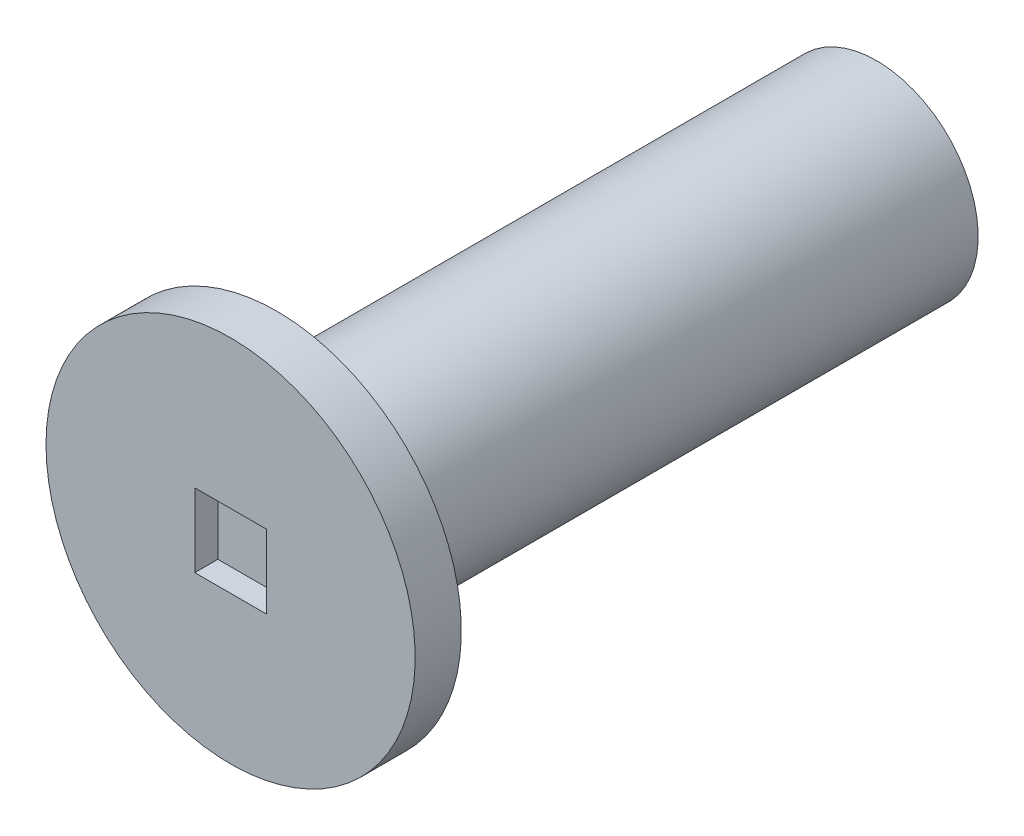
ISO-10303-21;
HEADER;
FILE_DESCRIPTION(('STEP AP214'),'2;1');
FILE_NAME('part.step','',(''),(''),'','','');
FILE_SCHEMA(('AUTOMOTIVE_DESIGN { 1 0 10303 214 1 1 1 1 }'));
ENDSEC;
DATA;
#1=APPLICATION_CONTEXT('core data for automotive mechanical design processes');
#2=APPLICATION_PROTOCOL_DEFINITION('international standard','automotive_design',2000,#1);
#3=PRODUCT_CONTEXT('',#1,'mechanical');
#4=PRODUCT('Part','Part','',(#3));
#5=PRODUCT_RELATED_PRODUCT_CATEGORY('part','',(#4));
#6=PRODUCT_DEFINITION_FORMATION('','',#4);
#7=PRODUCT_DEFINITION_CONTEXT('part definition',#1,'design');
#8=PRODUCT_DEFINITION('design','',#6,#7);
#9=PRODUCT_DEFINITION_SHAPE('','',#8);
#10=(LENGTH_UNIT() NAMED_UNIT(*) SI_UNIT(.MILLI.,.METRE.));
#11=(NAMED_UNIT(*) PLANE_ANGLE_UNIT() SI_UNIT($,.RADIAN.));
#12=(NAMED_UNIT(*) SI_UNIT($,.STERADIAN.) SOLID_ANGLE_UNIT());
#13=UNCERTAINTY_MEASURE_WITH_UNIT(LENGTH_MEASURE(1.E-05),#10,'distance_accuracy_value','');
#14=(GEOMETRIC_REPRESENTATION_CONTEXT(3) GLOBAL_UNCERTAINTY_ASSIGNED_CONTEXT((#13)) GLOBAL_UNIT_ASSIGNED_CONTEXT((#10,
#11,#12)) REPRESENTATION_CONTEXT('',''));
#15=CARTESIAN_POINT('',(0.,0.,0.));
#16=DIRECTION('',(0.,0.,1.));
#17=DIRECTION('',(1.,0.,0.));
#18=AXIS2_PLACEMENT_3D('',#15,#16,#17);
#19=CARTESIAN_POINT('',(0.,0.,0.));
#20=DIRECTION('',(0.,0.,1.));
#21=DIRECTION('',(1.,0.,0.));
#22=AXIS2_PLACEMENT_3D('',#19,#20,#21);
#23=PLANE('',#22);
#24=CARTESIAN_POINT('',(0.,0.,0.));
#25=DIRECTION('',(0.,0.,1.));
#26=DIRECTION('',(1.,0.,0.));
#27=AXIS2_PLACEMENT_3D('',#24,#25,#26);
#28=CIRCLE('',#27,2.2);
#29=CARTESIAN_POINT('',(-2.2,0.,0.));
#30=VERTEX_POINT('',#29);
#31=EDGE_CURVE('E20',#30,#30,#28,.T.);
#32=ORIENTED_EDGE('',*,*,#31,.T.);
#33=EDGE_LOOP('',(#32));
#34=FACE_BOUND('',#33,.T.);
#35=CARTESIAN_POINT('',(0.,0.,0.));
#36=DIRECTION('',(0.,0.,1.));
#37=DIRECTION('',(1.,0.,0.));
#38=AXIS2_PLACEMENT_3D('',#35,#36,#37);
#39=CIRCLE('',#38,4.);
#40=CARTESIAN_POINT('',(-4.,0.,0.));
#41=VERTEX_POINT('',#40);
#42=EDGE_CURVE('E11',#41,#41,#39,.T.);
#43=ORIENTED_EDGE('',*,*,#42,.F.);
#44=EDGE_LOOP('',(#43));
#45=FACE_BOUND('',#44,.T.);
#46=ADVANCED_FACE('F16',(#34,#45),#23,.F.);
#47=CARTESIAN_POINT('',(0.,0.,1.));
#48=DIRECTION('',(0.,0.,1.));
#49=DIRECTION('',(1.,0.,0.));
#50=AXIS2_PLACEMENT_3D('',#47,#48,#49);
#51=PLANE('',#50);
#52=DIRECTION('',(0.,1.,0.));
#53=VECTOR('',#52,1.);
#54=CARTESIAN_POINT('',(-0.775906475947883,-0.398152632129984,1.));
#55=LINE('',#54,#53);
#56=CARTESIAN_POINT('',(-0.775906475947883,-0.796305264259968,1.));
#57=VERTEX_POINT('',#56);
#58=CARTESIAN_POINT('',(-0.775906475947883,0.796305264259968,1.));
#59=VERTEX_POINT('',#58);
#60=EDGE_CURVE('E102',#57,#59,#55,.T.);
#61=ORIENTED_EDGE('',*,*,#60,.T.);
#62=DIRECTION('',(1.,0.,0.));
#63=VECTOR('',#62,1.);
#64=CARTESIAN_POINT('',(-0.387953237973941,0.796305264259968,1.));
#65=LINE('',#64,#63);
#66=CARTESIAN_POINT('',(0.775906475947883,0.796305264259968,1.));
#67=VERTEX_POINT('',#66);
#68=EDGE_CURVE('E135',#59,#67,#65,.T.);
#69=ORIENTED_EDGE('',*,*,#68,.T.);
#70=DIRECTION('',(0.,-1.,0.));
#71=VECTOR('',#70,1.);
#72=CARTESIAN_POINT('',(0.775906475947883,0.398152632129984,1.));
#73=LINE('',#72,#71);
#74=CARTESIAN_POINT('',(0.775906475947883,-0.796305264259968,1.));
#75=VERTEX_POINT('',#74);
#76=EDGE_CURVE('E118',#67,#75,#73,.T.);
#77=ORIENTED_EDGE('',*,*,#76,.T.);
#78=DIRECTION('',(-1.,0.,0.));
#79=VECTOR('',#78,1.);
#80=CARTESIAN_POINT('',(0.387953237973941,-0.796305264259968,1.));
#81=LINE('',#80,#79);
#82=EDGE_CURVE('E127',#75,#57,#81,.T.);
#83=ORIENTED_EDGE('',*,*,#82,.T.);
#84=EDGE_LOOP('',(#61,#69,#77,#83));
#85=FACE_BOUND('',#84,.T.);
#86=CARTESIAN_POINT('',(0.,0.,1.));
#87=DIRECTION('',(0.,0.,1.));
#88=DIRECTION('',(1.,0.,0.));
#89=AXIS2_PLACEMENT_3D('',#86,#87,#88);
#90=CIRCLE('',#89,4.);
#91=CARTESIAN_POINT('',(-4.,0.,1.));
#92=VERTEX_POINT('',#91);
#93=EDGE_CURVE('E121',#92,#92,#90,.T.);
#94=ORIENTED_EDGE('',*,*,#93,.T.);
#95=EDGE_LOOP('',(#94));
#96=FACE_BOUND('',#95,.T.);
#97=ADVANCED_FACE('F145',(#85,#96),#51,.T.);
#98=CARTESIAN_POINT('',(0.,0.,0.));
#99=DIRECTION('',(0.,0.,1.));
#100=DIRECTION('',(1.,0.,0.));
#101=AXIS2_PLACEMENT_3D('',#98,#99,#100);
#102=CYLINDRICAL_SURFACE('',#101,4.);
#103=ORIENTED_EDGE('',*,*,#93,.F.);
#104=DIRECTION('',(0.,0.,-1.));
#105=VECTOR('',#104,1.);
#106=CARTESIAN_POINT('',(-4.,0.,0.));
#107=LINE('',#106,#105);
#108=EDGE_CURVE('E27',#92,#41,#107,.T.);
#109=ORIENTED_EDGE('',*,*,#108,.T.);
#110=ORIENTED_EDGE('',*,*,#42,.T.);
#111=ORIENTED_EDGE('',*,*,#108,.F.);
#112=EDGE_LOOP('',(#103,#109,#110,#111));
#113=FACE_BOUND('',#112,.T.);
#114=ADVANCED_FACE('F233',(#113),#102,.T.);
#115=CARTESIAN_POINT('',(0.,0.,0.));
#116=DIRECTION('',(0.,0.,-1.));
#117=DIRECTION('',(1.,0.,0.));
#118=AXIS2_PLACEMENT_3D('',#115,#116,#117);
#119=CYLINDRICAL_SURFACE('',#118,2.2);
#120=CARTESIAN_POINT('',(0.,0.,-13.));
#121=DIRECTION('',(0.,0.,-1.));
#122=DIRECTION('',(1.,0.,0.));
#123=AXIS2_PLACEMENT_3D('',#120,#121,#122);
#124=CIRCLE('',#123,2.2);
#125=CARTESIAN_POINT('',(-2.2,0.,-13.));
#126=VERTEX_POINT('',#125);
#127=EDGE_CURVE('E96',#126,#126,#124,.T.);
#128=ORIENTED_EDGE('',*,*,#127,.F.);
#129=DIRECTION('',(0.,0.,1.));
#130=VECTOR('',#129,1.);
#131=CARTESIAN_POINT('',(-2.2,0.,0.));
#132=LINE('',#131,#130);
#133=EDGE_CURVE('E93',#126,#30,#132,.T.);
#134=ORIENTED_EDGE('',*,*,#133,.T.);
#135=ORIENTED_EDGE('',*,*,#31,.F.);
#136=ORIENTED_EDGE('',*,*,#133,.F.);
#137=EDGE_LOOP('',(#128,#134,#135,#136));
#138=FACE_BOUND('',#137,.T.);
#139=ADVANCED_FACE('F95',(#138),#119,.T.);
#140=CARTESIAN_POINT('',(0.,0.,0.5));
#141=DIRECTION('',(0.,0.,-1.));
#142=DIRECTION('',(0.,-1.,0.));
#143=AXIS2_PLACEMENT_3D('',#140,#141,#142);
#144=PLANE('',#143);
#145=DIRECTION('',(1.,0.,0.));
#146=VECTOR('',#145,1.);
#147=CARTESIAN_POINT('',(-0.775906475947883,0.796305264259968,0.5));
#148=LINE('',#147,#146);
#149=CARTESIAN_POINT('',(-0.775906475947883,0.796305264259968,0.5));
#150=VERTEX_POINT('',#149);
#151=CARTESIAN_POINT('',(0.775906475947883,0.796305264259968,0.5));
#152=VERTEX_POINT('',#151);
#153=EDGE_CURVE('E79',#150,#152,#148,.T.);
#154=ORIENTED_EDGE('',*,*,#153,.F.);
#155=DIRECTION('',(0.,1.,0.));
#156=VECTOR('',#155,1.);
#157=CARTESIAN_POINT('',(-0.775906475947883,-0.796305264259968,0.5));
#158=LINE('',#157,#156);
#159=CARTESIAN_POINT('',(-0.775906475947883,-0.796305264259968,0.5));
#160=VERTEX_POINT('',#159);
#161=EDGE_CURVE('E113',#160,#150,#158,.T.);
#162=ORIENTED_EDGE('',*,*,#161,.F.);
#163=DIRECTION('',(-1.,0.,0.));
#164=VECTOR('',#163,1.);
#165=CARTESIAN_POINT('',(0.775906475947883,-0.796305264259968,0.5));
#166=LINE('',#165,#164);
#167=CARTESIAN_POINT('',(0.775906475947883,-0.796305264259968,0.5));
#168=VERTEX_POINT('',#167);
#169=EDGE_CURVE('E67',#168,#160,#166,.T.);
#170=ORIENTED_EDGE('',*,*,#169,.F.);
#171=DIRECTION('',(0.,-1.,0.));
#172=VECTOR('',#171,1.);
#173=CARTESIAN_POINT('',(0.775906475947883,0.796305264259968,0.5));
#174=LINE('',#173,#172);
#175=EDGE_CURVE('E136',#152,#168,#174,.T.);
#176=ORIENTED_EDGE('',*,*,#175,.F.);
#177=EDGE_LOOP('',(#154,#162,#170,#176));
#178=FACE_BOUND('',#177,.T.);
#179=ADVANCED_FACE('F165',(#178),#144,.F.);
#180=CARTESIAN_POINT('',(-0.775906475947883,0.796305264259968,1.));
#181=DIRECTION('',(0.,1.,0.));
#182=DIRECTION('',(1.,0.,0.));
#183=AXIS2_PLACEMENT_3D('',#180,#181,#182);
#184=PLANE('',#183);
#185=ORIENTED_EDGE('',*,*,#68,.F.);
#186=DIRECTION('',(0.,0.,-1.));
#187=VECTOR('',#186,1.);
#188=CARTESIAN_POINT('',(-0.775906475947883,0.796305264259968,1.));
#189=LINE('',#188,#187);
#190=EDGE_CURVE('E117',#59,#150,#189,.T.);
#191=ORIENTED_EDGE('',*,*,#190,.T.);
#192=ORIENTED_EDGE('',*,*,#153,.T.);
#193=DIRECTION('',(0.,0.,-1.));
#194=VECTOR('',#193,1.);
#195=CARTESIAN_POINT('',(0.775906475947883,0.796305264259968,1.));
#196=LINE('',#195,#194);
#197=EDGE_CURVE('E112',#67,#152,#196,.T.);
#198=ORIENTED_EDGE('',*,*,#197,.F.);
#199=EDGE_LOOP('',(#185,#191,#192,#198));
#200=FACE_BOUND('',#199,.T.);
#201=ADVANCED_FACE('F18',(#200),#184,.F.);
#202=CARTESIAN_POINT('',(0.775906475947883,0.796305264259968,1.));
#203=DIRECTION('',(1.,0.,0.));
#204=DIRECTION('',(0.,1.,0.));
#205=AXIS2_PLACEMENT_3D('',#202,#203,#204);
#206=PLANE('',#205);
#207=ORIENTED_EDGE('',*,*,#76,.F.);
#208=ORIENTED_EDGE('',*,*,#197,.T.);
#209=ORIENTED_EDGE('',*,*,#175,.T.);
#210=DIRECTION('',(0.,0.,-1.));
#211=VECTOR('',#210,1.);
#212=CARTESIAN_POINT('',(0.775906475947883,-0.796305264259968,1.));
#213=LINE('',#212,#211);
#214=EDGE_CURVE('E130',#75,#168,#213,.T.);
#215=ORIENTED_EDGE('',*,*,#214,.F.);
#216=EDGE_LOOP('',(#207,#208,#209,#215));
#217=FACE_BOUND('',#216,.T.);
#218=ADVANCED_FACE('F155',(#217),#206,.F.);
#219=CARTESIAN_POINT('',(0.775906475947883,-0.796305264259968,1.));
#220=DIRECTION('',(0.,-1.,0.));
#221=DIRECTION('',(0.,0.,-1.));
#222=AXIS2_PLACEMENT_3D('',#219,#220,#221);
#223=PLANE('',#222);
#224=ORIENTED_EDGE('',*,*,#82,.F.);
#225=ORIENTED_EDGE('',*,*,#214,.T.);
#226=ORIENTED_EDGE('',*,*,#169,.T.);
#227=DIRECTION('',(0.,0.,-1.));
#228=VECTOR('',#227,1.);
#229=CARTESIAN_POINT('',(-0.775906475947883,-0.796305264259968,1.));
#230=LINE('',#229,#228);
#231=EDGE_CURVE('E109',#57,#160,#230,.T.);
#232=ORIENTED_EDGE('',*,*,#231,.F.);
#233=EDGE_LOOP('',(#224,#225,#226,#232));
#234=FACE_BOUND('',#233,.T.);
#235=ADVANCED_FACE('F159',(#234),#223,.F.);
#236=CARTESIAN_POINT('',(-0.775906475947883,-0.796305264259968,1.));
#237=DIRECTION('',(-1.,0.,0.));
#238=DIRECTION('',(0.,0.,1.));
#239=AXIS2_PLACEMENT_3D('',#236,#237,#238);
#240=PLANE('',#239);
#241=ORIENTED_EDGE('',*,*,#60,.F.);
#242=ORIENTED_EDGE('',*,*,#231,.T.);
#243=ORIENTED_EDGE('',*,*,#161,.T.);
#244=ORIENTED_EDGE('',*,*,#190,.F.);
#245=EDGE_LOOP('',(#241,#242,#243,#244));
#246=FACE_BOUND('',#245,.T.);
#247=ADVANCED_FACE('F164',(#246),#240,.F.);
#248=CARTESIAN_POINT('',(0.,0.,-13.));
#249=DIRECTION('',(0.,0.,1.));
#250=DIRECTION('',(1.,0.,0.));
#251=AXIS2_PLACEMENT_3D('',#248,#249,#250);
#252=PLANE('',#251);
#253=ORIENTED_EDGE('',*,*,#127,.T.);
#254=EDGE_LOOP('',(#253));
#255=FACE_BOUND('',#254,.T.);
#256=ADVANCED_FACE('F100',(#255),#252,.F.);
#257=CLOSED_SHELL('',(#46,#97,#114,#139,#179,#201,#218,#235,#247,#256));
#258=MANIFOLD_SOLID_BREP('B1',#257);
#259=ADVANCED_BREP_SHAPE_REPRESENTATION('',(#18,#258),#14);
#260=SHAPE_DEFINITION_REPRESENTATION(#9,#259);
ENDSEC;
END-ISO-10303-21;
